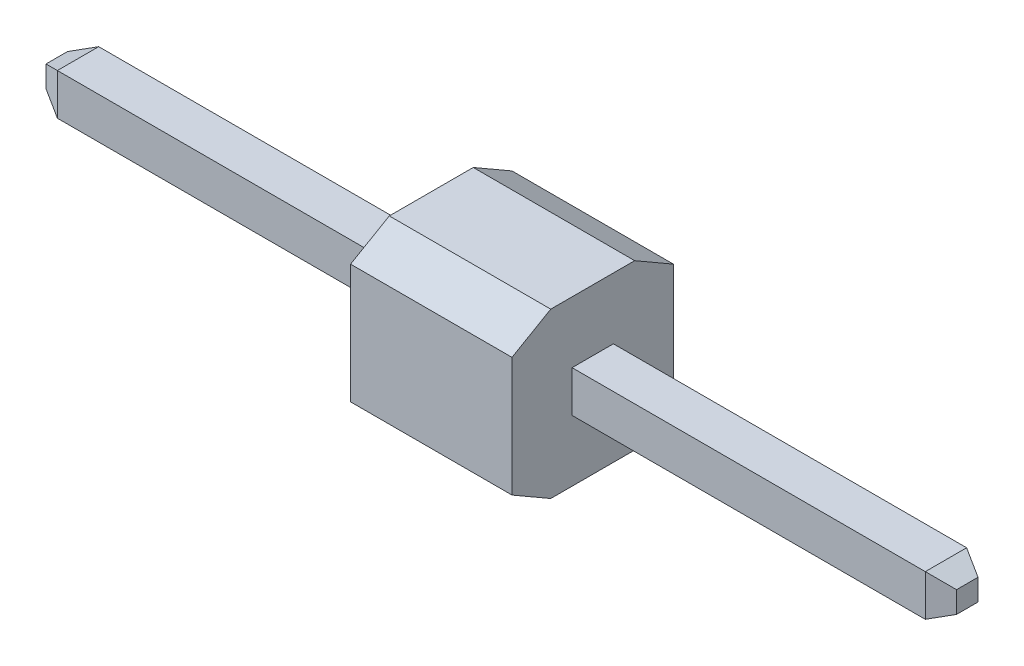
ISO-10303-21;
HEADER;
FILE_DESCRIPTION(('STEP AP214'),'2;1');
FILE_NAME('part.step','',(''),(''),'','','');
FILE_SCHEMA(('AUTOMOTIVE_DESIGN { 1 0 10303 214 1 1 1 1 }'));
ENDSEC;
DATA;
#1=APPLICATION_CONTEXT('core data for automotive mechanical design processes');
#2=APPLICATION_PROTOCOL_DEFINITION('international standard','automotive_design',2000,#1);
#3=PRODUCT_CONTEXT('',#1,'mechanical');
#4=PRODUCT('Part','Part','',(#3));
#5=PRODUCT_RELATED_PRODUCT_CATEGORY('part','',(#4));
#6=PRODUCT_DEFINITION_FORMATION('','',#4);
#7=PRODUCT_DEFINITION_CONTEXT('part definition',#1,'design');
#8=PRODUCT_DEFINITION('design','',#6,#7);
#9=PRODUCT_DEFINITION_SHAPE('','',#8);
#10=(LENGTH_UNIT() NAMED_UNIT(*) SI_UNIT(.MILLI.,.METRE.));
#11=(NAMED_UNIT(*) PLANE_ANGLE_UNIT() SI_UNIT($,.RADIAN.));
#12=(NAMED_UNIT(*) SI_UNIT($,.STERADIAN.) SOLID_ANGLE_UNIT());
#13=UNCERTAINTY_MEASURE_WITH_UNIT(LENGTH_MEASURE(1.E-05),#10,'distance_accuracy_value','');
#14=(GEOMETRIC_REPRESENTATION_CONTEXT(3) GLOBAL_UNCERTAINTY_ASSIGNED_CONTEXT((#13)) GLOBAL_UNIT_ASSIGNED_CONTEXT((#10,
#11,#12)) REPRESENTATION_CONTEXT('',''));
#15=CARTESIAN_POINT('',(0.,0.,0.));
#16=DIRECTION('',(0.,0.,1.));
#17=DIRECTION('',(1.,0.,0.));
#18=AXIS2_PLACEMENT_3D('',#15,#16,#17);
#19=CARTESIAN_POINT('',(5.42105026104071,-2.85712826291391,0.629998634255617));
#20=DIRECTION('',(1.,4.37113882867379E-08,-4.37113882867379E-08));
#21=DIRECTION('',(-4.37113882867379E-08,1.,0.));
#22=AXIS2_PLACEMENT_3D('',#19,#20,#21);
#23=PLANE('',#22);
#24=DIRECTION('',(1.59994777304463E-08,0.500000000000193,0.866025403784327));
#25=VECTOR('',#24,1.);
#26=CARTESIAN_POINT('',(5.42105013805479,-1.61353842442391,-0.940001365744382));
#27=LINE('',#26,#25);
#28=CARTESIAN_POINT('',(5.42105013805479,-1.61353842442391,-0.940001365744382));
#29=VERTEX_POINT('',#28);
#30=CARTESIAN_POINT('',(5.42105014913955,-1.26712826291391,-0.340001365744383));
#31=VERTEX_POINT('',#30);
#32=EDGE_CURVE('E11',#29,#31,#27,.T.);
#33=ORIENTED_EDGE('',*,*,#32,.T.);
#34=DIRECTION('',(4.37113886966664E-08,0.,0.999999999999999));
#35=VECTOR('',#34,1.);
#36=CARTESIAN_POINT('',(5.42105014913955,-1.26712826291391,-0.340001365744383));
#37=LINE('',#36,#35);
#38=CARTESIAN_POINT('',(5.42105020596436,-1.26712826291391,0.959998634255618));
#39=VERTEX_POINT('',#38);
#40=EDGE_CURVE('E304',#31,#39,#37,.T.);
#41=ORIENTED_EDGE('',*,*,#40,.T.);
#42=DIRECTION('',(5.97108668825761E-08,-0.500000000000188,0.866025403784328));
#43=VECTOR('',#42,1.);
#44=CARTESIAN_POINT('',(5.42105020596436,-1.26712826291391,0.959998634255618));
#45=LINE('',#44,#43);
#46=CARTESIAN_POINT('',(5.42105024733326,-1.61353842442391,1.55999863425562));
#47=VERTEX_POINT('',#46);
#48=EDGE_CURVE('E296',#39,#47,#45,.T.);
#49=ORIENTED_EDGE('',*,*,#48,.T.);
#50=DIRECTION('',(4.37113884815545E-08,-0.999999999999999,0.));
#51=VECTOR('',#50,1.);
#52=CARTESIAN_POINT('',(5.42105024733326,-1.61353842442391,1.55999863425562));
#53=LINE('',#52,#51);
#54=CARTESIAN_POINT('',(5.42105032807605,-3.46071810139391,1.55999863425562));
#55=VERTEX_POINT('',#54);
#56=EDGE_CURVE('E281',#47,#55,#53,.T.);
#57=ORIENTED_EDGE('',*,*,#56,.T.);
#58=DIRECTION('',(1.5999479012306E-08,0.500000000000193,0.866025403784327));
#59=VECTOR('',#58,1.);
#60=CARTESIAN_POINT('',(5.42105031699128,-3.80712826291391,0.959998634255618));
#61=LINE('',#60,#59);
#62=CARTESIAN_POINT('',(5.42105031699128,-3.80712826291391,0.959998634255618));
#63=VERTEX_POINT('',#62);
#64=EDGE_CURVE('E265',#63,#55,#61,.T.);
#65=ORIENTED_EDGE('',*,*,#64,.F.);
#66=DIRECTION('',(4.37113886966664E-08,0.,0.999999999999999));
#67=VECTOR('',#66,1.);
#68=CARTESIAN_POINT('',(5.42105026016648,-3.80712826291392,-0.340001365744383));
#69=LINE('',#68,#67);
#70=CARTESIAN_POINT('',(5.42105026016648,-3.80712826291392,-0.340001365744383));
#71=VERTEX_POINT('',#70);
#72=EDGE_CURVE('E248',#71,#63,#69,.T.);
#73=ORIENTED_EDGE('',*,*,#72,.F.);
#74=DIRECTION('',(5.97108656001698E-08,-0.50000000000019,0.866025403784327));
#75=VECTOR('',#74,1.);
#76=CARTESIAN_POINT('',(5.42105021879758,-3.46071810139392,-0.940001365744382));
#77=LINE('',#76,#75);
#78=CARTESIAN_POINT('',(5.42105021879758,-3.46071810139392,-0.940001365744382));
#79=VERTEX_POINT('',#78);
#80=EDGE_CURVE('E242',#79,#71,#77,.T.);
#81=ORIENTED_EDGE('',*,*,#80,.F.);
#82=DIRECTION('',(4.37113884815545E-08,-0.999999999999999,0.));
#83=VECTOR('',#82,1.);
#84=CARTESIAN_POINT('',(5.42105013805479,-1.61353842442391,-0.940001365744382));
#85=LINE('',#84,#83);
#86=EDGE_CURVE('E236',#29,#79,#85,.T.);
#87=ORIENTED_EDGE('',*,*,#86,.F.);
#88=EDGE_LOOP('',(#33,#41,#49,#57,#65,#73,#81,#87));
#89=FACE_BOUND('',#88,.T.);
#90=DIRECTION('',(-4.37113886753159E-08,0.,-0.999999999999999));
#91=VECTOR('',#90,1.);
#92=CARTESIAN_POINT('',(5.42105023306542,-2.21712826291391,0.629998634255617));
#93=LINE('',#92,#91);
#94=CARTESIAN_POINT('',(5.42105023306542,-2.21712826291391,0.629998634255617));
#95=VERTEX_POINT('',#94);
#96=CARTESIAN_POINT('',(5.42105020509013,-2.21712826291391,-0.0100013657443826));
#97=VERTEX_POINT('',#96);
#98=EDGE_CURVE('E302',#95,#97,#93,.T.);
#99=ORIENTED_EDGE('',*,*,#98,.T.);
#100=DIRECTION('',(-4.3711388675316E-08,0.999999999999999,0.));
#101=VECTOR('',#100,1.);
#102=CARTESIAN_POINT('',(5.42105023306542,-2.85712826291391,-0.0100013657443826));
#103=LINE('',#102,#101);
#104=CARTESIAN_POINT('',(5.42105023306542,-2.85712826291391,-0.0100013657443826));
#105=VERTEX_POINT('',#104);
#106=EDGE_CURVE('E293',#105,#97,#103,.T.);
#107=ORIENTED_EDGE('',*,*,#106,.F.);
#108=DIRECTION('',(-4.37113886753159E-08,0.,-0.999999999999999));
#109=VECTOR('',#108,1.);
#110=CARTESIAN_POINT('',(5.42105026104071,-2.85712826291391,0.629998634255617));
#111=LINE('',#110,#109);
#112=CARTESIAN_POINT('',(5.42105026104071,-2.85712826291391,0.629998634255617));
#113=VERTEX_POINT('',#112);
#114=EDGE_CURVE('E278',#113,#105,#111,.T.);
#115=ORIENTED_EDGE('',*,*,#114,.F.);
#116=DIRECTION('',(-4.3711388675316E-08,0.999999999999999,0.));
#117=VECTOR('',#116,1.);
#118=CARTESIAN_POINT('',(5.42105026104071,-2.85712826291391,0.629998634255617));
#119=LINE('',#118,#117);
#120=EDGE_CURVE('E263',#113,#95,#119,.T.);
#121=ORIENTED_EDGE('',*,*,#120,.T.);
#122=EDGE_LOOP('',(#99,#107,#115,#121));
#123=FACE_BOUND('',#122,.T.);
#124=ADVANCED_FACE('F17',(#89,#123),#23,.T.);
#125=CARTESIAN_POINT('',(2.92105026104071,-2.85712837219238,0.629998743534088));
#126=DIRECTION('',(1.,4.37113882867379E-08,-4.37113882867379E-08));
#127=DIRECTION('',(-4.37113882867379E-08,1.,0.));
#128=AXIS2_PLACEMENT_3D('',#125,#126,#127);
#129=PLANE('',#128);
#130=DIRECTION('',(1.59994783714339E-08,0.500000000000193,0.866025403784327));
#131=VECTOR('',#130,1.);
#132=CARTESIAN_POINT('',(2.92105013805479,-1.61353853370239,-0.940001256465912));
#133=LINE('',#132,#131);
#134=CARTESIAN_POINT('',(2.92105013805479,-1.61353853370239,-0.940001256465912));
#135=VERTEX_POINT('',#134);
#136=CARTESIAN_POINT('',(2.92105014913955,-1.26712837219238,-0.340001256465912));
#137=VERTEX_POINT('',#136);
#138=EDGE_CURVE('E24',#135,#137,#133,.T.);
#139=ORIENTED_EDGE('',*,*,#138,.F.);
#140=DIRECTION('',(4.37113882411397E-08,-0.999999999999999,0.));
#141=VECTOR('',#140,1.);
#142=CARTESIAN_POINT('',(2.92105013805479,-1.61353853370239,-0.940001256465912));
#143=LINE('',#142,#141);
#144=CARTESIAN_POINT('',(2.92105021879758,-3.46071821067239,-0.940001256465912));
#145=VERTEX_POINT('',#144);
#146=EDGE_CURVE('E300',#135,#145,#143,.T.);
#147=ORIENTED_EDGE('',*,*,#146,.T.);
#148=DIRECTION('',(5.97108668821449E-08,-0.50000000000019,0.866025403784327));
#149=VECTOR('',#148,1.);
#150=CARTESIAN_POINT('',(2.92105021879758,-3.46071821067239,-0.940001256465912));
#151=LINE('',#150,#149);
#152=CARTESIAN_POINT('',(2.92105026016648,-3.80712837219239,-0.340001256465912));
#153=VERTEX_POINT('',#152);
#154=EDGE_CURVE('E286',#145,#153,#151,.T.);
#155=ORIENTED_EDGE('',*,*,#154,.T.);
#156=DIRECTION('',(4.37113883550593E-08,0.,0.999999999999999));
#157=VECTOR('',#156,1.);
#158=CARTESIAN_POINT('',(2.92105026016648,-3.80712837219239,-0.340001256465912));
#159=LINE('',#158,#157);
#160=CARTESIAN_POINT('',(2.92105031699128,-3.80712837219238,0.959998743534088));
#161=VERTEX_POINT('',#160);
#162=EDGE_CURVE('E271',#153,#161,#159,.T.);
#163=ORIENTED_EDGE('',*,*,#162,.T.);
#164=DIRECTION('',(1.59994783713184E-08,0.500000000000193,0.866025403784327));
#165=VECTOR('',#164,1.);
#166=CARTESIAN_POINT('',(2.92105031699128,-3.80712837219238,0.959998743534088));
#167=LINE('',#166,#165);
#168=CARTESIAN_POINT('',(2.92105032807605,-3.46071821067238,1.55999874353409));
#169=VERTEX_POINT('',#168);
#170=EDGE_CURVE('E253',#161,#169,#167,.T.);
#171=ORIENTED_EDGE('',*,*,#170,.T.);
#172=DIRECTION('',(4.37113882411397E-08,-0.999999999999999,0.));
#173=VECTOR('',#172,1.);
#174=CARTESIAN_POINT('',(2.92105024733326,-1.61353853370238,1.55999874353409));
#175=LINE('',#174,#173);
#176=CARTESIAN_POINT('',(2.92105024733326,-1.61353853370238,1.55999874353409));
#177=VERTEX_POINT('',#176);
#178=EDGE_CURVE('E261',#177,#169,#175,.T.);
#179=ORIENTED_EDGE('',*,*,#178,.F.);
#180=DIRECTION('',(5.97108668825761E-08,-0.500000000000188,0.866025403784328));
#181=VECTOR('',#180,1.);
#182=CARTESIAN_POINT('',(2.92105020596436,-1.26712837219238,0.959998743534088));
#183=LINE('',#182,#181);
#184=CARTESIAN_POINT('',(2.92105020596436,-1.26712837219238,0.959998743534088));
#185=VERTEX_POINT('',#184);
#186=EDGE_CURVE('E276',#185,#177,#183,.T.);
#187=ORIENTED_EDGE('',*,*,#186,.F.);
#188=DIRECTION('',(4.37113883550593E-08,0.,0.999999999999999));
#189=VECTOR('',#188,1.);
#190=CARTESIAN_POINT('',(2.92105014913955,-1.26712837219238,-0.340001256465912));
#191=LINE('',#190,#189);
#192=EDGE_CURVE('E291',#137,#185,#191,.T.);
#193=ORIENTED_EDGE('',*,*,#192,.F.);
#194=EDGE_LOOP('',(#139,#147,#155,#163,#171,#179,#187,#193));
#195=FACE_BOUND('',#194,.T.);
#196=DIRECTION('',(-4.3711388675316E-08,0.999999999999999,0.));
#197=VECTOR('',#196,1.);
#198=CARTESIAN_POINT('',(2.92105023306542,-2.85712837219238,-0.0100012564659119));
#199=LINE('',#198,#197);
#200=CARTESIAN_POINT('',(2.92105023306542,-2.85712837219238,-0.0100012564659119));
#201=VERTEX_POINT('',#200);
#202=CARTESIAN_POINT('',(2.92105020509013,-2.21712837219238,-0.0100012564659119));
#203=VERTEX_POINT('',#202);
#204=EDGE_CURVE('E298',#201,#203,#199,.T.);
#205=ORIENTED_EDGE('',*,*,#204,.T.);
#206=DIRECTION('',(-4.37113886753159E-08,0.,-0.999999999999999));
#207=VECTOR('',#206,1.);
#208=CARTESIAN_POINT('',(2.92105023306542,-2.21712837219238,0.629998743534088));
#209=LINE('',#208,#207);
#210=CARTESIAN_POINT('',(2.92105023306542,-2.21712837219238,0.629998743534088));
#211=VERTEX_POINT('',#210);
#212=EDGE_CURVE('E283',#211,#203,#209,.T.);
#213=ORIENTED_EDGE('',*,*,#212,.F.);
#214=DIRECTION('',(-4.37113879814266E-08,0.999999999999999,0.));
#215=VECTOR('',#214,1.);
#216=CARTESIAN_POINT('',(2.92105026104071,-2.85712837219238,0.629998743534088));
#217=LINE('',#216,#215);
#218=CARTESIAN_POINT('',(2.92105026104071,-2.85712837219238,0.629998743534088));
#219=VERTEX_POINT('',#218);
#220=EDGE_CURVE('E268',#219,#211,#217,.T.);
#221=ORIENTED_EDGE('',*,*,#220,.F.);
#222=DIRECTION('',(-4.37113879814266E-08,0.,-0.999999999999999));
#223=VECTOR('',#222,1.);
#224=CARTESIAN_POINT('',(2.92105026104071,-2.85712837219238,0.629998743534088));
#225=LINE('',#224,#223);
#226=EDGE_CURVE('E251',#219,#201,#225,.T.);
#227=ORIENTED_EDGE('',*,*,#226,.T.);
#228=EDGE_LOOP('',(#205,#213,#221,#227));
#229=FACE_BOUND('',#228,.T.);
#230=ADVANCED_FACE('F314',(#195,#229),#129,.F.);
#231=CARTESIAN_POINT('',(5.42105013805479,-1.61353842442391,-0.940001365744382));
#232=DIRECTION('',(5.97108668343731E-08,-0.866025403784328,0.50000000000019));
#233=DIRECTION('',(-1.59994785476185E-08,-0.500000000000192,-0.866025403784329));
#234=AXIS2_PLACEMENT_3D('',#231,#232,#233);
#235=PLANE('',#234);
#236=ORIENTED_EDGE('',*,*,#138,.T.);
#237=DIRECTION('',(-0.999999999999998,-4.37113875761951E-08,4.37113883755557E-08));
#238=VECTOR('',#237,1.);
#239=CARTESIAN_POINT('',(5.42105014913955,-1.26712826291391,-0.340001365744383));
#240=LINE('',#239,#238);
#241=EDGE_CURVE('E288',#31,#137,#240,.T.);
#242=ORIENTED_EDGE('',*,*,#241,.F.);
#243=ORIENTED_EDGE('',*,*,#32,.F.);
#244=DIRECTION('',(-0.999999999999998,-4.37113882867378E-08,4.37113881091022E-08));
#245=VECTOR('',#244,1.);
#246=CARTESIAN_POINT('',(5.42105013805479,-1.61353842442391,-0.940001365744382));
#247=LINE('',#246,#245);
#248=EDGE_CURVE('E256',#29,#135,#247,.T.);
#249=ORIENTED_EDGE('',*,*,#248,.T.);
#250=EDGE_LOOP('',(#236,#242,#243,#249));
#251=FACE_BOUND('',#250,.T.);
#252=ADVANCED_FACE('F306',(#251),#235,.F.);
#253=CARTESIAN_POINT('',(5.42105014913955,-1.26712826291391,-0.340001365744383));
#254=DIRECTION('',(4.37113882867379E-08,-1.,0.));
#255=DIRECTION('',(1.,4.37113882867379E-08,-4.37113882867379E-08));
#256=AXIS2_PLACEMENT_3D('',#253,#254,#255);
#257=PLANE('',#256);
#258=ORIENTED_EDGE('',*,*,#192,.T.);
#259=DIRECTION('',(-0.999999999999998,-4.37113875761951E-08,4.37113882867378E-08));
#260=VECTOR('',#259,1.);
#261=CARTESIAN_POINT('',(5.42105020596436,-1.26712826291391,0.959998634255618));
#262=LINE('',#261,#260);
#263=EDGE_CURVE('E273',#39,#185,#262,.T.);
#264=ORIENTED_EDGE('',*,*,#263,.F.);
#265=ORIENTED_EDGE('',*,*,#40,.F.);
#266=ORIENTED_EDGE('',*,*,#241,.T.);
#267=EDGE_LOOP('',(#258,#264,#265,#266));
#268=FACE_BOUND('',#267,.T.);
#269=ADVANCED_FACE('F311',(#268),#257,.F.);
#270=CARTESIAN_POINT('',(5.42105020596436,-1.26712826291391,0.959998634255618));
#271=DIRECTION('',(1.59994785476185E-08,-0.86602540378433,-0.50000000000019));
#272=DIRECTION('',(-5.97108668343731E-08,0.500000000000188,-0.866025403784329));
#273=AXIS2_PLACEMENT_3D('',#270,#271,#272);
#274=PLANE('',#273);
#275=ORIENTED_EDGE('',*,*,#186,.T.);
#276=DIRECTION('',(-0.999999999999998,-4.37113882867378E-08,4.37113882867378E-08));
#277=VECTOR('',#276,1.);
#278=CARTESIAN_POINT('',(5.42105024733326,-1.61353842442391,1.55999863425562));
#279=LINE('',#278,#277);
#280=EDGE_CURVE('E258',#47,#177,#279,.T.);
#281=ORIENTED_EDGE('',*,*,#280,.F.);
#282=ORIENTED_EDGE('',*,*,#48,.F.);
#283=ORIENTED_EDGE('',*,*,#263,.T.);
#284=EDGE_LOOP('',(#275,#281,#282,#283));
#285=FACE_BOUND('',#284,.T.);
#286=ADVANCED_FACE('F319',(#285),#274,.F.);
#287=CARTESIAN_POINT('',(5.42105024733326,-1.61353842442391,1.55999863425562));
#288=DIRECTION('',(-4.37113882867379E-08,0.,-1.));
#289=DIRECTION('',(-1.,-4.37113882867379E-08,4.37113882867379E-08));
#290=AXIS2_PLACEMENT_3D('',#287,#288,#289);
#291=PLANE('',#290);
#292=ORIENTED_EDGE('',*,*,#178,.T.);
#293=DIRECTION('',(-0.999999999999998,-4.37113882867378E-08,4.37113882867378E-08));
#294=VECTOR('',#293,1.);
#295=CARTESIAN_POINT('',(5.42105032807605,-3.46071810139391,1.55999863425562));
#296=LINE('',#295,#294);
#297=EDGE_CURVE('E245',#55,#169,#296,.T.);
#298=ORIENTED_EDGE('',*,*,#297,.F.);
#299=ORIENTED_EDGE('',*,*,#56,.F.);
#300=ORIENTED_EDGE('',*,*,#280,.T.);
#301=EDGE_LOOP('',(#292,#298,#299,#300));
#302=FACE_BOUND('',#301,.T.);
#303=ADVANCED_FACE('F326',(#302),#291,.F.);
#304=CARTESIAN_POINT('',(5.42105031699128,-3.80712826291391,0.959998634255618));
#305=DIRECTION('',(5.97108668343731E-08,-0.866025403784328,0.50000000000019));
#306=DIRECTION('',(-1.59994785476185E-08,-0.500000000000192,-0.866025403784329));
#307=AXIS2_PLACEMENT_3D('',#304,#305,#306);
#308=PLANE('',#307);
#309=ORIENTED_EDGE('',*,*,#170,.F.);
#310=DIRECTION('',(-0.999999999999998,-4.37113868656524E-08,4.37113882867378E-08));
#311=VECTOR('',#310,1.);
#312=CARTESIAN_POINT('',(5.42105031699128,-3.80712826291391,0.959998634255618));
#313=LINE('',#312,#311);
#314=EDGE_CURVE('E239',#63,#161,#313,.T.);
#315=ORIENTED_EDGE('',*,*,#314,.F.);
#316=ORIENTED_EDGE('',*,*,#64,.T.);
#317=ORIENTED_EDGE('',*,*,#297,.T.);
#318=EDGE_LOOP('',(#309,#315,#316,#317));
#319=FACE_BOUND('',#318,.T.);
#320=ADVANCED_FACE('F329',(#319),#308,.T.);
#321=CARTESIAN_POINT('',(5.42105026016648,-3.80712826291392,-0.340001365744383));
#322=DIRECTION('',(4.37113882867379E-08,-1.,0.));
#323=DIRECTION('',(1.,4.37113882867379E-08,-4.37113882867379E-08));
#324=AXIS2_PLACEMENT_3D('',#321,#322,#323);
#325=PLANE('',#324);
#326=ORIENTED_EDGE('',*,*,#162,.F.);
#327=DIRECTION('',(-0.999999999999998,-4.37113868656524E-08,4.37113883755557E-08));
#328=VECTOR('',#327,1.);
#329=CARTESIAN_POINT('',(5.42105026016648,-3.80712826291392,-0.340001365744383));
#330=LINE('',#329,#328);
#331=EDGE_CURVE('E233',#71,#153,#330,.T.);
#332=ORIENTED_EDGE('',*,*,#331,.F.);
#333=ORIENTED_EDGE('',*,*,#72,.T.);
#334=ORIENTED_EDGE('',*,*,#314,.T.);
#335=EDGE_LOOP('',(#326,#332,#333,#334));
#336=FACE_BOUND('',#335,.T.);
#337=ADVANCED_FACE('F333',(#336),#325,.T.);
#338=CARTESIAN_POINT('',(5.42105021879758,-3.46071810139392,-0.940001365744382));
#339=DIRECTION('',(1.59994785476185E-08,-0.86602540378433,-0.50000000000019));
#340=DIRECTION('',(-5.97108668343731E-08,0.500000000000188,-0.866025403784329));
#341=AXIS2_PLACEMENT_3D('',#338,#339,#340);
#342=PLANE('',#341);
#343=ORIENTED_EDGE('',*,*,#154,.F.);
#344=DIRECTION('',(-0.999999999999998,-4.37113882867378E-08,4.37113881091021E-08));
#345=VECTOR('',#344,1.);
#346=CARTESIAN_POINT('',(5.42105021879758,-3.46071810139392,-0.940001365744382));
#347=LINE('',#346,#345);
#348=EDGE_CURVE('E230',#79,#145,#347,.T.);
#349=ORIENTED_EDGE('',*,*,#348,.F.);
#350=ORIENTED_EDGE('',*,*,#80,.T.);
#351=ORIENTED_EDGE('',*,*,#331,.T.);
#352=EDGE_LOOP('',(#343,#349,#350,#351));
#353=FACE_BOUND('',#352,.T.);
#354=ADVANCED_FACE('F337',(#353),#342,.T.);
#355=CARTESIAN_POINT('',(5.42105013805479,-1.61353842442391,-0.940001365744382));
#356=DIRECTION('',(-4.37113882867379E-08,0.,-1.));
#357=DIRECTION('',(-4.37113882867379E-08,1.,0.));
#358=AXIS2_PLACEMENT_3D('',#355,#356,#357);
#359=PLANE('',#358);
#360=ORIENTED_EDGE('',*,*,#146,.F.);
#361=ORIENTED_EDGE('',*,*,#248,.F.);
#362=ORIENTED_EDGE('',*,*,#86,.T.);
#363=ORIENTED_EDGE('',*,*,#348,.T.);
#364=EDGE_LOOP('',(#360,#361,#362,#363));
#365=FACE_BOUND('',#364,.T.);
#366=ADVANCED_FACE('F339',(#365),#359,.T.);
#367=CARTESIAN_POINT('',(-2.87894973895929,-2.85712862571843,0.62999899706014));
#368=DIRECTION('',(-1.,-4.37113882867379E-08,4.37113882867379E-08));
#369=DIRECTION('',(4.37113882867379E-08,-1.,0.));
#370=AXIS2_PLACEMENT_3D('',#367,#368,#369);
#371=PLANE('',#370);
#372=DIRECTION('',(4.3711387402424E-08,-0.999999999999999,0.));
#373=VECTOR('',#372,1.);
#374=CARTESIAN_POINT('',(-2.87894978145712,-2.37101015290844,0.14388052425114));
#375=LINE('',#374,#373);
#376=CARTESIAN_POINT('',(-2.87894978145712,-2.37101015290844,0.14388052425114));
#377=VERTEX_POINT('',#376);
#378=CARTESIAN_POINT('',(-2.87894976693458,-2.70324709851844,0.14388052425114));
#379=VERTEX_POINT('',#378);
#380=EDGE_CURVE('E228',#377,#379,#375,.T.);
#381=ORIENTED_EDGE('',*,*,#380,.T.);
#382=DIRECTION('',(4.37113874013716E-08,0.,0.999999999999999));
#383=VECTOR('',#382,1.);
#384=CARTESIAN_POINT('',(-2.87894976693458,-2.70324709851844,0.14388052425114));
#385=LINE('',#384,#383);
#386=CARTESIAN_POINT('',(-2.87894975241204,-2.70324709851844,0.47611746986914));
#387=VERTEX_POINT('',#386);
#388=EDGE_CURVE('E223',#379,#387,#385,.T.);
#389=ORIENTED_EDGE('',*,*,#388,.T.);
#390=DIRECTION('',(-4.37113900757526E-08,0.999999999999999,0.));
#391=VECTOR('',#390,1.);
#392=CARTESIAN_POINT('',(-2.87894975241204,-2.70324709851843,0.47611746986914));
#393=LINE('',#392,#391);
#394=CARTESIAN_POINT('',(-2.87894976693458,-2.37101015290843,0.47611746986914));
#395=VERTEX_POINT('',#394);
#396=EDGE_CURVE('E215',#387,#395,#393,.T.);
#397=ORIENTED_EDGE('',*,*,#396,.T.);
#398=DIRECTION('',(-4.37113847280434E-08,0.,-0.999999999999999));
#399=VECTOR('',#398,1.);
#400=CARTESIAN_POINT('',(-2.87894976693458,-2.37101015290843,0.47611746986914));
#401=LINE('',#400,#399);
#402=EDGE_CURVE('E207',#395,#377,#401,.T.);
#403=ORIENTED_EDGE('',*,*,#402,.T.);
#404=EDGE_LOOP('',(#381,#389,#397,#403));
#405=FACE_BOUND('',#404,.T.);
#406=ADVANCED_FACE('F341',(#405),#371,.T.);
#407=CARTESIAN_POINT('',(-2.87894973895929,-2.85712862571843,0.62999899706014));
#408=DIRECTION('',(4.37113882867379E-08,-1.,0.));
#409=DIRECTION('',(-4.37113882867379E-08,0.,-1.));
#410=AXIS2_PLACEMENT_3D('',#407,#408,#409);
#411=PLANE('',#410);
#412=DIRECTION('',(0.999999999999998,4.37113891700451E-08,-4.37113882769955E-08));
#413=VECTOR('',#412,1.);
#414=CARTESIAN_POINT('',(-2.54894973895929,-2.85712861129368,0.629998982635382));
#415=LINE('',#414,#413);
#416=CARTESIAN_POINT('',(-2.54894973895929,-2.85712861129368,0.629998982635382));
#417=VERTEX_POINT('',#416);
#418=EDGE_CURVE('E225',#417,#219,#415,.T.);
#419=ORIENTED_EDGE('',*,*,#418,.F.);
#420=DIRECTION('',(-4.37113886753159E-08,0.,-0.999999999999999));
#421=VECTOR('',#420,1.);
#422=CARTESIAN_POINT('',(-2.54894973895929,-2.85712861129368,0.629998982635382));
#423=LINE('',#422,#421);
#424=CARTESIAN_POINT('',(-2.54894976693458,-2.85712861129368,-0.010001017364618));
#425=VERTEX_POINT('',#424);
#426=EDGE_CURVE('E217',#417,#425,#423,.T.);
#427=ORIENTED_EDGE('',*,*,#426,.T.);
#428=DIRECTION('',(0.999999999999998,4.37113891700451E-08,-4.37113882161057E-08));
#429=VECTOR('',#428,1.);
#430=CARTESIAN_POINT('',(-2.54894976693458,-2.85712861129368,-0.010001017364618));
#431=LINE('',#430,#429);
#432=EDGE_CURVE('E220',#425,#201,#431,.T.);
#433=ORIENTED_EDGE('',*,*,#432,.T.);
#434=ORIENTED_EDGE('',*,*,#226,.F.);
#435=EDGE_LOOP('',(#419,#427,#433,#434));
#436=FACE_BOUND('',#435,.T.);
#437=ADVANCED_FACE('F348',(#436),#411,.T.);
#438=CARTESIAN_POINT('',(-2.87894976693458,-2.85712862571844,-0.0100010029398598));
#439=DIRECTION('',(-4.37113882867379E-08,0.,-1.));
#440=DIRECTION('',(-1.,-4.37113882867379E-08,4.37113882867379E-08));
#441=AXIS2_PLACEMENT_3D('',#438,#439,#440);
#442=PLANE('',#441);
#443=ORIENTED_EDGE('',*,*,#432,.F.);
#444=DIRECTION('',(-4.3711388675316E-08,0.999999999999999,0.));
#445=VECTOR('',#444,1.);
#446=CARTESIAN_POINT('',(-2.54894976693458,-2.85712861129368,-0.010001017364618));
#447=LINE('',#446,#445);
#448=CARTESIAN_POINT('',(-2.54894979490987,-2.21712861129368,-0.010001017364618));
#449=VERTEX_POINT('',#448);
#450=EDGE_CURVE('E209',#425,#449,#447,.T.);
#451=ORIENTED_EDGE('',*,*,#450,.T.);
#452=DIRECTION('',(0.999999999999998,4.37113888452998E-08,-4.37113882161057E-08));
#453=VECTOR('',#452,1.);
#454=CARTESIAN_POINT('',(-2.54894979490987,-2.21712861129368,-0.010001017364618));
#455=LINE('',#454,#453);
#456=EDGE_CURVE('E212',#449,#203,#455,.T.);
#457=ORIENTED_EDGE('',*,*,#456,.T.);
#458=ORIENTED_EDGE('',*,*,#204,.F.);
#459=EDGE_LOOP('',(#443,#451,#457,#458));
#460=FACE_BOUND('',#459,.T.);
#461=ADVANCED_FACE('F424',(#460),#442,.T.);
#462=CARTESIAN_POINT('',(-2.87894976693458,-2.21712862571843,0.62999899706014));
#463=DIRECTION('',(4.37113882867379E-08,-1.,0.));
#464=DIRECTION('',(-4.37113882867379E-08,0.,-1.));
#465=AXIS2_PLACEMENT_3D('',#462,#463,#464);
#466=PLANE('',#465);
#467=ORIENTED_EDGE('',*,*,#456,.F.);
#468=DIRECTION('',(4.37113900630947E-08,0.,0.999999999999999));
#469=VECTOR('',#468,1.);
#470=CARTESIAN_POINT('',(-2.54894979490987,-2.21712861129368,-0.010001017364618));
#471=LINE('',#470,#469);
#472=CARTESIAN_POINT('',(-2.54894976693458,-2.21712861129368,0.629998982635382));
#473=VERTEX_POINT('',#472);
#474=EDGE_CURVE('E201',#449,#473,#471,.T.);
#475=ORIENTED_EDGE('',*,*,#474,.T.);
#476=DIRECTION('',(0.999999999999998,4.37113888452998E-08,-4.37113882769955E-08));
#477=VECTOR('',#476,1.);
#478=CARTESIAN_POINT('',(-2.54894976693458,-2.21712861129367,0.629998982635382));
#479=LINE('',#478,#477);
#480=EDGE_CURVE('E204',#473,#211,#479,.T.);
#481=ORIENTED_EDGE('',*,*,#480,.T.);
#482=ORIENTED_EDGE('',*,*,#212,.T.);
#483=EDGE_LOOP('',(#467,#475,#481,#482));
#484=FACE_BOUND('',#483,.T.);
#485=ADVANCED_FACE('F421',(#484),#466,.F.);
#486=CARTESIAN_POINT('',(-2.87894973895929,-2.85712862571843,0.62999899706014));
#487=DIRECTION('',(-4.37113882867379E-08,0.,-1.));
#488=DIRECTION('',(-1.,-4.37113882867379E-08,4.37113882867379E-08));
#489=AXIS2_PLACEMENT_3D('',#486,#487,#488);
#490=PLANE('',#489);
#491=ORIENTED_EDGE('',*,*,#480,.F.);
#492=DIRECTION('',(4.37113900630948E-08,-0.999999999999999,0.));
#493=VECTOR('',#492,1.);
#494=CARTESIAN_POINT('',(-2.54894976693458,-2.21712861129368,0.629998982635382));
#495=LINE('',#494,#493);
#496=EDGE_CURVE('E196',#473,#417,#495,.T.);
#497=ORIENTED_EDGE('',*,*,#496,.T.);
#498=ORIENTED_EDGE('',*,*,#418,.T.);
#499=ORIENTED_EDGE('',*,*,#220,.T.);
#500=EDGE_LOOP('',(#491,#497,#498,#499));
#501=FACE_BOUND('',#500,.T.);
#502=ADVANCED_FACE('F376',(#501),#490,.F.);
#503=CARTESIAN_POINT('',(-2.87894973895929,-2.85712862571843,0.62999899706014));
#504=DIRECTION('',(-4.37113882867379E-08,0.,-1.));
#505=DIRECTION('',(-1.,-4.37113882867379E-08,4.37113882867379E-08));
#506=AXIS2_PLACEMENT_3D('',#503,#504,#505);
#507=PLANE('',#506);
#508=DIRECTION('',(0.999999999999998,4.37113933917341E-08,-4.37113882769955E-08));
#509=VECTOR('',#508,1.);
#510=CARTESIAN_POINT('',(5.42105026104071,-2.85712826291392,0.629998634255617));
#511=LINE('',#510,#509);
#512=CARTESIAN_POINT('',(10.8910502610407,-2.85712802381262,0.629998395154324));
#513=VERTEX_POINT('',#512);
#514=EDGE_CURVE('E199',#113,#513,#511,.T.);
#515=ORIENTED_EDGE('',*,*,#514,.T.);
#516=DIRECTION('',(-4.37113900630948E-08,0.999999999999999,0.));
#517=VECTOR('',#516,1.);
#518=CARTESIAN_POINT('',(10.8910502610407,-2.85712802381262,0.629998395154324));
#519=LINE('',#518,#517);
#520=CARTESIAN_POINT('',(10.8910502330654,-2.21712802381262,0.629998395154324));
#521=VERTEX_POINT('',#520);
#522=EDGE_CURVE('E191',#513,#521,#519,.T.);
#523=ORIENTED_EDGE('',*,*,#522,.T.);
#524=DIRECTION('',(0.999999999999998,4.37113829998842E-08,-4.37113882769955E-08));
#525=VECTOR('',#524,1.);
#526=CARTESIAN_POINT('',(5.42105023306542,-2.21712826291391,0.629998634255617));
#527=LINE('',#526,#525);
#528=EDGE_CURVE('E194',#95,#521,#527,.T.);
#529=ORIENTED_EDGE('',*,*,#528,.F.);
#530=ORIENTED_EDGE('',*,*,#120,.F.);
#531=EDGE_LOOP('',(#515,#523,#529,#530));
#532=FACE_BOUND('',#531,.T.);
#533=ADVANCED_FACE('F367',(#532),#507,.F.);
#534=CARTESIAN_POINT('',(-2.87894976693458,-2.21712862571843,0.62999899706014));
#535=DIRECTION('',(4.37113882867379E-08,-1.,0.));
#536=DIRECTION('',(-4.37113882867379E-08,0.,-1.));
#537=AXIS2_PLACEMENT_3D('',#534,#535,#536);
#538=PLANE('',#537);
#539=ORIENTED_EDGE('',*,*,#528,.T.);
#540=DIRECTION('',(-4.37113900630947E-08,0.,-0.999999999999999));
#541=VECTOR('',#540,1.);
#542=CARTESIAN_POINT('',(10.8910502330654,-2.21712802381262,0.629998395154324));
#543=LINE('',#542,#541);
#544=CARTESIAN_POINT('',(10.8910502050901,-2.21712802381262,-0.0100016048456765));
#545=VERTEX_POINT('',#544);
#546=EDGE_CURVE('E186',#521,#545,#543,.T.);
#547=ORIENTED_EDGE('',*,*,#546,.T.);
#548=DIRECTION('',(0.999999999999998,4.37113829998842E-08,-4.37113881146228E-08));
#549=VECTOR('',#548,1.);
#550=CARTESIAN_POINT('',(5.42105020509013,-2.21712826291391,-0.0100013657443823));
#551=LINE('',#550,#549);
#552=EDGE_CURVE('E189',#97,#545,#551,.T.);
#553=ORIENTED_EDGE('',*,*,#552,.F.);
#554=ORIENTED_EDGE('',*,*,#98,.F.);
#555=EDGE_LOOP('',(#539,#547,#553,#554));
#556=FACE_BOUND('',#555,.T.);
#557=ADVANCED_FACE('F364',(#556),#538,.F.);
#558=CARTESIAN_POINT('',(-2.87894976693458,-2.85712862571844,-0.0100010029398598));
#559=DIRECTION('',(-4.37113882867379E-08,0.,-1.));
#560=DIRECTION('',(-1.,-4.37113882867379E-08,4.37113882867379E-08));
#561=AXIS2_PLACEMENT_3D('',#558,#559,#560);
#562=PLANE('',#561);
#563=ORIENTED_EDGE('',*,*,#552,.T.);
#564=DIRECTION('',(4.37113872875372E-08,-0.999999999999999,0.));
#565=VECTOR('',#564,1.);
#566=CARTESIAN_POINT('',(10.8910502050901,-2.21712802381262,-0.0100016048456764));
#567=LINE('',#566,#565);
#568=CARTESIAN_POINT('',(10.8910502330654,-2.85712802381262,-0.0100016048456765));
#569=VERTEX_POINT('',#568);
#570=EDGE_CURVE('E176',#545,#569,#567,.T.);
#571=ORIENTED_EDGE('',*,*,#570,.T.);
#572=DIRECTION('',(0.999999999999998,4.37113933917341E-08,-4.37113881146228E-08));
#573=VECTOR('',#572,1.);
#574=CARTESIAN_POINT('',(5.42105023306542,-2.85712826291392,-0.0100013657443823));
#575=LINE('',#574,#573);
#576=EDGE_CURVE('E179',#105,#569,#575,.T.);
#577=ORIENTED_EDGE('',*,*,#576,.F.);
#578=ORIENTED_EDGE('',*,*,#106,.T.);
#579=EDGE_LOOP('',(#563,#571,#577,#578));
#580=FACE_BOUND('',#579,.T.);
#581=ADVANCED_FACE('F366',(#580),#562,.T.);
#582=CARTESIAN_POINT('',(-2.87894973895929,-2.85712862571843,0.62999899706014));
#583=DIRECTION('',(4.37113882867379E-08,-1.,0.));
#584=DIRECTION('',(-4.37113882867379E-08,0.,-1.));
#585=AXIS2_PLACEMENT_3D('',#582,#583,#584);
#586=PLANE('',#585);
#587=ORIENTED_EDGE('',*,*,#576,.T.);
#588=DIRECTION('',(4.37113845119796E-08,0.,0.999999999999999));
#589=VECTOR('',#588,1.);
#590=CARTESIAN_POINT('',(10.8910502330654,-2.85712802381262,-0.0100016048456765));
#591=LINE('',#590,#589);
#592=EDGE_CURVE('E167',#569,#513,#591,.T.);
#593=ORIENTED_EDGE('',*,*,#592,.T.);
#594=ORIENTED_EDGE('',*,*,#514,.F.);
#595=ORIENTED_EDGE('',*,*,#114,.T.);
#596=EDGE_LOOP('',(#587,#593,#594,#595));
#597=FACE_BOUND('',#596,.T.);
#598=ADVANCED_FACE('F373',(#597),#586,.T.);
#599=CARTESIAN_POINT('',(11.2210502610407,-2.85712800938786,0.629998380729565));
#600=DIRECTION('',(-1.,-4.37113882867379E-08,4.37113882867379E-08));
#601=DIRECTION('',(4.37113882867379E-08,-1.,0.));
#602=AXIS2_PLACEMENT_3D('',#599,#600,#601);
#603=PLANE('',#602);
#604=DIRECTION('',(-4.37113874024243E-08,0.999999999999999,0.));
#605=VECTOR('',#604,1.);
#606=CARTESIAN_POINT('',(11.2210502330654,-2.70324648218786,0.143879907920565));
#607=LINE('',#606,#605);
#608=CARTESIAN_POINT('',(11.2210502330654,-2.70324648218786,0.143879907920565));
#609=VERTEX_POINT('',#608);
#610=CARTESIAN_POINT('',(11.2210502185429,-2.37100953657786,0.143879907920565));
#611=VERTEX_POINT('',#610);
#612=EDGE_CURVE('E153',#609,#611,#607,.T.);
#613=ORIENTED_EDGE('',*,*,#612,.T.);
#614=DIRECTION('',(4.37113874013716E-08,0.,0.999999999999999));
#615=VECTOR('',#614,1.);
#616=CARTESIAN_POINT('',(11.2210502185429,-2.37100953657787,0.143879907920565));
#617=LINE('',#616,#615);
#618=CARTESIAN_POINT('',(11.2210502330654,-2.37100953657786,0.476116853538565));
#619=VERTEX_POINT('',#618);
#620=EDGE_CURVE('E395',#611,#619,#617,.T.);
#621=ORIENTED_EDGE('',*,*,#620,.T.);
#622=DIRECTION('',(4.37113927490806E-08,-0.999999999999999,0.));
#623=VECTOR('',#622,1.);
#624=CARTESIAN_POINT('',(11.2210502330654,-2.37100953657786,0.476116853538565));
#625=LINE('',#624,#623);
#626=CARTESIAN_POINT('',(11.221050247588,-2.70324648218786,0.476116853538565));
#627=VERTEX_POINT('',#626);
#628=EDGE_CURVE('E156',#619,#627,#625,.T.);
#629=ORIENTED_EDGE('',*,*,#628,.T.);
#630=DIRECTION('',(-4.37113980946847E-08,0.,-0.999999999999999));
#631=VECTOR('',#630,1.);
#632=CARTESIAN_POINT('',(11.221050247588,-2.70324648218786,0.476116853538565));
#633=LINE('',#632,#631);
#634=EDGE_CURVE('E149',#627,#609,#633,.T.);
#635=ORIENTED_EDGE('',*,*,#634,.T.);
#636=EDGE_LOOP('',(#613,#621,#629,#635));
#637=FACE_BOUND('',#636,.T.);
#638=ADVANCED_FACE('F151',(#637),#603,.F.);
#639=CARTESIAN_POINT('',(-2.87894976020821,-2.37101015290843,0.62999899706014));
#640=DIRECTION('',(-0.422618301356784,0.906307768563367,1.84732310895534E-08));
#641=DIRECTION('',(4.37113882867379E-08,0.,1.));
#642=AXIS2_PLACEMENT_3D('',#639,#640,#641);
#643=PLANE('',#642);
#644=DIRECTION('',(0.834817095446927,0.389281657126017,-0.389281657126018));
#645=VECTOR('',#644,1.);
#646=CARTESIAN_POINT('',(-2.87894978145714,-2.37101015290792,0.143880524251623));
#647=LINE('',#646,#645);
#648=EDGE_CURVE('E181',#377,#449,#647,.T.);
#649=ORIENTED_EDGE('',*,*,#648,.F.);
#650=ORIENTED_EDGE('',*,*,#402,.F.);
#651=DIRECTION('',(-0.834817129479006,-0.389281657126019,-0.389281584143989));
#652=VECTOR('',#651,1.);
#653=CARTESIAN_POINT('',(-2.54894976693501,-2.21712861129221,0.629998982634844));
#654=LINE('',#653,#652);
#655=EDGE_CURVE('E404',#473,#395,#654,.T.);
#656=ORIENTED_EDGE('',*,*,#655,.F.);
#657=ORIENTED_EDGE('',*,*,#474,.F.);
#658=EDGE_LOOP('',(#649,#650,#656,#657));
#659=FACE_BOUND('',#658,.T.);
#660=ADVANCED_FACE('F418',(#659),#643,.T.);
#661=CARTESIAN_POINT('',(-2.87894974568567,-2.85712862571843,0.47611746986914));
#662=DIRECTION('',(-0.422618222124841,-1.84732292043498E-08,0.906307805509828));
#663=DIRECTION('',(4.37113882867379E-08,-1.,0.));
#664=AXIS2_PLACEMENT_3D('',#661,#662,#663);
#665=PLANE('',#664);
#666=ORIENTED_EDGE('',*,*,#655,.T.);
#667=ORIENTED_EDGE('',*,*,#396,.F.);
#668=DIRECTION('',(-0.834817163511088,0.389281584143984,-0.389281584143987));
#669=VECTOR('',#668,1.);
#670=CARTESIAN_POINT('',(-2.54894973895814,-2.85712861129095,0.629998982635654));
#671=LINE('',#670,#669);
#672=EDGE_CURVE('E160',#417,#387,#671,.T.);
#673=ORIENTED_EDGE('',*,*,#672,.F.);
#674=ORIENTED_EDGE('',*,*,#496,.F.);
#675=EDGE_LOOP('',(#666,#667,#673,#674));
#676=FACE_BOUND('',#675,.T.);
#677=ADVANCED_FACE('F434',(#676),#665,.T.);
#678=CARTESIAN_POINT('',(-2.54894976693458,-2.85712861129368,-0.010001017364618));
#679=DIRECTION('',(0.422618301356784,1.8473232667688E-08,0.906307768563367));
#680=DIRECTION('',(-4.37113882867379E-08,1.,0.));
#681=AXIS2_PLACEMENT_3D('',#678,#679,#680);
#682=PLANE('',#681);
#683=ORIENTED_EDGE('',*,*,#648,.T.);
#684=ORIENTED_EDGE('',*,*,#450,.F.);
#685=DIRECTION('',(0.834817129479008,-0.389281584143985,-0.389281657126018));
#686=VECTOR('',#685,1.);
#687=CARTESIAN_POINT('',(-2.87894976693742,-2.70324709852598,0.1438805242526));
#688=LINE('',#687,#686);
#689=EDGE_CURVE('E170',#379,#425,#688,.T.);
#690=ORIENTED_EDGE('',*,*,#689,.F.);
#691=ORIENTED_EDGE('',*,*,#380,.F.);
#692=EDGE_LOOP('',(#683,#684,#690,#691));
#693=FACE_BOUND('',#692,.T.);
#694=ADVANCED_FACE('F413',(#693),#682,.F.);
#695=CARTESIAN_POINT('',(-2.54894973895929,-2.85712861129368,0.629998982635382));
#696=DIRECTION('',(0.422618222124841,0.906307805509828,-1.84732308250282E-08));
#697=DIRECTION('',(-4.37113882867379E-08,0.,-1.));
#698=AXIS2_PLACEMENT_3D('',#695,#696,#697);
#699=PLANE('',#698);
#700=ORIENTED_EDGE('',*,*,#672,.T.);
#701=ORIENTED_EDGE('',*,*,#388,.F.);
#702=ORIENTED_EDGE('',*,*,#689,.T.);
#703=ORIENTED_EDGE('',*,*,#426,.F.);
#704=EDGE_LOOP('',(#700,#701,#702,#703));
#705=FACE_BOUND('',#704,.T.);
#706=ADVANCED_FACE('F429',(#705),#699,.F.);
#707=CARTESIAN_POINT('',(11.2210502543143,-2.70324648218786,0.629998380729565));
#708=DIRECTION('',(0.422618301356784,-0.906307768563367,-1.84732310470096E-08));
#709=DIRECTION('',(4.37113882867379E-08,0.,1.));
#710=AXIS2_PLACEMENT_3D('',#707,#708,#709);
#711=PLANE('',#710);
#712=DIRECTION('',(-0.834817129479007,-0.389281657126017,-0.389281584143988));
#713=VECTOR('',#712,1.);
#714=CARTESIAN_POINT('',(11.2210502330654,-2.70324648218838,0.143879907921048));
#715=LINE('',#714,#713);
#716=EDGE_CURVE('E164',#609,#569,#715,.T.);
#717=ORIENTED_EDGE('',*,*,#716,.F.);
#718=ORIENTED_EDGE('',*,*,#634,.F.);
#719=DIRECTION('',(0.834817095446928,0.389281657126015,-0.389281657126018));
#720=VECTOR('',#719,1.);
#721=CARTESIAN_POINT('',(10.8910502610407,-2.85712802381262,0.629998395154324));
#722=LINE('',#721,#720);
#723=EDGE_CURVE('E392',#513,#627,#722,.T.);
#724=ORIENTED_EDGE('',*,*,#723,.F.);
#725=ORIENTED_EDGE('',*,*,#592,.F.);
#726=EDGE_LOOP('',(#717,#718,#724,#725));
#727=FACE_BOUND('',#726,.T.);
#728=ADVANCED_FACE('F165',(#727),#711,.T.);
#729=CARTESIAN_POINT('',(10.8910502610407,-2.85712802381262,0.629998395154324));
#730=DIRECTION('',(-0.422618301356784,-1.8473232667688E-08,-0.906307768563367));
#731=DIRECTION('',(-4.37113882867379E-08,1.,0.));
#732=AXIS2_PLACEMENT_3D('',#729,#730,#731);
#733=PLANE('',#732);
#734=ORIENTED_EDGE('',*,*,#723,.T.);
#735=ORIENTED_EDGE('',*,*,#628,.F.);
#736=DIRECTION('',(0.834817129479004,-0.389281584143993,-0.389281657126018));
#737=VECTOR('',#736,1.);
#738=CARTESIAN_POINT('',(10.891050233067,-2.21712802380841,0.629998395153421));
#739=LINE('',#738,#737);
#740=EDGE_CURVE('E389',#521,#619,#739,.T.);
#741=ORIENTED_EDGE('',*,*,#740,.F.);
#742=ORIENTED_EDGE('',*,*,#522,.F.);
#743=EDGE_LOOP('',(#734,#735,#741,#742));
#744=FACE_BOUND('',#743,.T.);
#745=ADVANCED_FACE('F390',(#744),#733,.F.);
#746=CARTESIAN_POINT('',(11.2210502397918,-2.85712800938786,0.143879907920565));
#747=DIRECTION('',(0.422618222124841,1.84732292043498E-08,-0.906307805509828));
#748=DIRECTION('',(4.37113882867379E-08,-1.,0.));
#749=AXIS2_PLACEMENT_3D('',#746,#747,#748);
#750=PLANE('',#749);
#751=ORIENTED_EDGE('',*,*,#716,.T.);
#752=ORIENTED_EDGE('',*,*,#570,.F.);
#753=DIRECTION('',(-0.834817163511087,0.389281584143985,-0.389281584143988));
#754=VECTOR('',#753,1.);
#755=CARTESIAN_POINT('',(11.2210502185429,-2.37100953657734,0.143879907921048));
#756=LINE('',#755,#754);
#757=EDGE_CURVE('E175',#611,#545,#756,.T.);
#758=ORIENTED_EDGE('',*,*,#757,.F.);
#759=ORIENTED_EDGE('',*,*,#612,.F.);
#760=EDGE_LOOP('',(#751,#752,#758,#759));
#761=FACE_BOUND('',#760,.T.);
#762=ADVANCED_FACE('F173',(#761),#750,.T.);
#763=CARTESIAN_POINT('',(10.8910502330654,-2.21712802381262,0.629998395154324));
#764=DIRECTION('',(-0.422618222124841,-0.906307805509828,1.84732307824844E-08));
#765=DIRECTION('',(-4.37113882867379E-08,0.,-1.));
#766=AXIS2_PLACEMENT_3D('',#763,#764,#765);
#767=PLANE('',#766);
#768=ORIENTED_EDGE('',*,*,#740,.T.);
#769=ORIENTED_EDGE('',*,*,#620,.F.);
#770=ORIENTED_EDGE('',*,*,#757,.T.);
#771=ORIENTED_EDGE('',*,*,#546,.F.);
#772=EDGE_LOOP('',(#768,#769,#770,#771));
#773=FACE_BOUND('',#772,.T.);
#774=ADVANCED_FACE('F394',(#773),#767,.F.);
#775=CLOSED_SHELL('',(#124,#230,#252,#269,#286,#303,#320,#337,#354,#366,#406,#437,#461,#485,
#502,#533,#557,#581,#598,#638,#660,#677,#694,#706,#728,#745,#762,#774));
#776=MANIFOLD_SOLID_BREP('B1',#775);
#777=ADVANCED_BREP_SHAPE_REPRESENTATION('',(#18,#776),#14);
#778=SHAPE_DEFINITION_REPRESENTATION(#9,#777);
ENDSEC;
END-ISO-10303-21;
